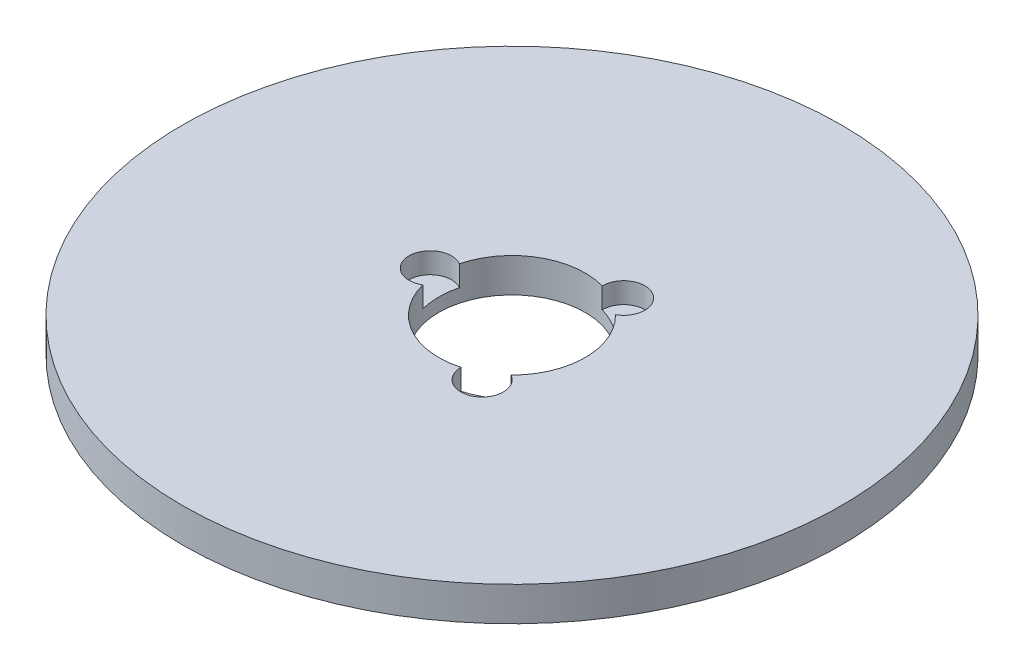
ISO-10303-21;
HEADER;
FILE_DESCRIPTION(('STEP AP214'),'2;1');
FILE_NAME('part.step','',(''),(''),'','','');
FILE_SCHEMA(('AUTOMOTIVE_DESIGN { 1 0 10303 214 1 1 1 1 }'));
ENDSEC;
DATA;
#1=APPLICATION_CONTEXT('core data for automotive mechanical design processes');
#2=APPLICATION_PROTOCOL_DEFINITION('international standard','automotive_design',2000,#1);
#3=PRODUCT_CONTEXT('',#1,'mechanical');
#4=PRODUCT('Part','Part','',(#3));
#5=PRODUCT_RELATED_PRODUCT_CATEGORY('part','',(#4));
#6=PRODUCT_DEFINITION_FORMATION('','',#4);
#7=PRODUCT_DEFINITION_CONTEXT('part definition',#1,'design');
#8=PRODUCT_DEFINITION('design','',#6,#7);
#9=PRODUCT_DEFINITION_SHAPE('','',#8);
#10=(LENGTH_UNIT() NAMED_UNIT(*) SI_UNIT(.MILLI.,.METRE.));
#11=(NAMED_UNIT(*) PLANE_ANGLE_UNIT() SI_UNIT($,.RADIAN.));
#12=(NAMED_UNIT(*) SI_UNIT($,.STERADIAN.) SOLID_ANGLE_UNIT());
#13=UNCERTAINTY_MEASURE_WITH_UNIT(LENGTH_MEASURE(1.E-05),#10,'distance_accuracy_value','');
#14=(GEOMETRIC_REPRESENTATION_CONTEXT(3) GLOBAL_UNCERTAINTY_ASSIGNED_CONTEXT((#13)) GLOBAL_UNIT_ASSIGNED_CONTEXT((#10,
#11,#12)) REPRESENTATION_CONTEXT('',''));
#15=CARTESIAN_POINT('',(0.,0.,0.));
#16=DIRECTION('',(0.,0.,1.));
#17=DIRECTION('',(1.,0.,0.));
#18=AXIS2_PLACEMENT_3D('',#15,#16,#17);
#19=CARTESIAN_POINT('',(0.,7.,0.));
#20=DIRECTION('',(0.,-1.,0.));
#21=DIRECTION('',(0.,0.,-1.));
#22=AXIS2_PLACEMENT_3D('',#19,#20,#21);
#23=CYLINDRICAL_SURFACE('',#22,67.5);
#24=CARTESIAN_POINT('',(0.,7.,0.));
#25=DIRECTION('',(0.,1.,0.));
#26=DIRECTION('',(0.,0.,1.));
#27=AXIS2_PLACEMENT_3D('',#24,#25,#26);
#28=CIRCLE('',#27,67.5);
#29=CARTESIAN_POINT('',(0.,7.,67.5));
#30=VERTEX_POINT('',#29);
#31=EDGE_CURVE('E126',#30,#30,#28,.T.);
#32=ORIENTED_EDGE('',*,*,#31,.F.);
#33=EDGE_LOOP('',(#32));
#34=FACE_BOUND('',#33,.T.);
#35=CARTESIAN_POINT('',(0.,0.,0.));
#36=DIRECTION('',(0.,1.,0.));
#37=DIRECTION('',(0.,0.,1.));
#38=AXIS2_PLACEMENT_3D('',#35,#36,#37);
#39=CIRCLE('',#38,67.5);
#40=CARTESIAN_POINT('',(0.,0.,67.5));
#41=VERTEX_POINT('',#40);
#42=EDGE_CURVE('E124',#41,#41,#39,.T.);
#43=ORIENTED_EDGE('',*,*,#42,.T.);
#44=EDGE_LOOP('',(#43));
#45=FACE_BOUND('',#44,.T.);
#46=ADVANCED_FACE('F39',(#34,#45),#23,.T.);
#47=CARTESIAN_POINT('',(0.,7.,0.));
#48=DIRECTION('',(0.,1.,0.));
#49=DIRECTION('',(0.,0.,1.));
#50=AXIS2_PLACEMENT_3D('',#47,#48,#49);
#51=PLANE('',#50);
#52=CARTESIAN_POINT('',(8.36943908511699,7.,14.4962937262753));
#53=DIRECTION('',(0.,1.,0.));
#54=DIRECTION('',(0.866025403784436,0.,-0.500000000000004));
#55=AXIS2_PLACEMENT_3D('',#52,#53,#54);
#56=CIRCLE('',#55,4.3513850673904);
#57=CARTESIAN_POINT('',(4.01828189581641,7.,14.451761505289));
#58=VERTEX_POINT('',#57);
#59=CARTESIAN_POINT('',(10.5064516451062,7.,10.7058149539885));
#60=VERTEX_POINT('',#59);
#61=EDGE_CURVE('E147',#58,#60,#56,.T.);
#62=ORIENTED_EDGE('',*,*,#61,.F.);
#63=CARTESIAN_POINT('',(0.,7.,0.));
#64=DIRECTION('',(0.,1.,0.));
#65=DIRECTION('',(0.,0.,1.));
#66=AXIS2_PLACEMENT_3D('',#63,#64,#65);
#67=CIRCLE('',#66,15.);
#68=CARTESIAN_POINT('',(-14.5247335409225,7.,3.74594655130048));
#69=VERTEX_POINT('',#68);
#70=EDGE_CURVE('E118',#69,#58,#67,.T.);
#71=ORIENTED_EDGE('',*,*,#70,.F.);
#72=CARTESIAN_POINT('',(-16.7388781702338,7.,0.));
#73=DIRECTION('',(0.,1.,0.));
#74=DIRECTION('',(0.,0.,1.));
#75=AXIS2_PLACEMENT_3D('',#72,#73,#74);
#76=CIRCLE('',#75,4.3513850673904);
#77=CARTESIAN_POINT('',(-14.5247335409225,7.,-3.74594655130048));
#78=VERTEX_POINT('',#77);
#79=EDGE_CURVE('E113',#78,#69,#76,.T.);
#80=ORIENTED_EDGE('',*,*,#79,.F.);
#81=CARTESIAN_POINT('',(4.0182818958162,7.,-14.4517615052891));
#82=VERTEX_POINT('',#81);
#83=EDGE_CURVE('E106',#82,#78,#67,.T.);
#84=ORIENTED_EDGE('',*,*,#83,.F.);
#85=CARTESIAN_POINT('',(8.36943908511679,7.,-14.4962937262754));
#86=DIRECTION('',(0.,1.,0.));
#87=DIRECTION('',(-0.866025403784443,0.,-0.499999999999992));
#88=AXIS2_PLACEMENT_3D('',#85,#86,#87);
#89=CIRCLE('',#88,4.3513850673904);
#90=CARTESIAN_POINT('',(10.5064516451061,7.,-10.7058149539887));
#91=VERTEX_POINT('',#90);
#92=EDGE_CURVE('E90',#91,#82,#89,.T.);
#93=ORIENTED_EDGE('',*,*,#92,.F.);
#94=EDGE_CURVE('E116',#60,#91,#67,.T.);
#95=ORIENTED_EDGE('',*,*,#94,.F.);
#96=EDGE_LOOP('',(#62,#71,#80,#84,#93,#95));
#97=FACE_BOUND('',#96,.T.);
#98=ORIENTED_EDGE('',*,*,#31,.T.);
#99=EDGE_LOOP('',(#98));
#100=FACE_BOUND('',#99,.T.);
#101=ADVANCED_FACE('F115',(#97,#100),#51,.T.);
#102=CARTESIAN_POINT('',(0.,0.,0.));
#103=DIRECTION('',(0.,1.,0.));
#104=DIRECTION('',(0.,0.,1.));
#105=AXIS2_PLACEMENT_3D('',#102,#103,#104);
#106=PLANE('',#105);
#107=CARTESIAN_POINT('',(0.,0.,0.));
#108=DIRECTION('',(0.,1.,0.));
#109=DIRECTION('',(0.,0.,1.));
#110=AXIS2_PLACEMENT_3D('',#107,#108,#109);
#111=CIRCLE('',#110,15.);
#112=CARTESIAN_POINT('',(0.,0.,15.));
#113=VERTEX_POINT('',#112);
#114=EDGE_CURVE('E120',#113,#113,#111,.T.);
#115=ORIENTED_EDGE('',*,*,#114,.T.);
#116=EDGE_LOOP('',(#115));
#117=FACE_BOUND('',#116,.T.);
#118=ORIENTED_EDGE('',*,*,#42,.F.);
#119=EDGE_LOOP('',(#118));
#120=FACE_BOUND('',#119,.T.);
#121=ADVANCED_FACE('F164',(#117,#120),#106,.F.);
#122=CARTESIAN_POINT('',(0.,7.,0.));
#123=DIRECTION('',(0.,-1.,0.));
#124=DIRECTION('',(0.,0.,-1.));
#125=AXIS2_PLACEMENT_3D('',#122,#123,#124);
#126=CYLINDRICAL_SURFACE('',#125,15.);
#127=DIRECTION('',(0.,1.,0.));
#128=VECTOR('',#127,1.);
#129=CARTESIAN_POINT('',(4.01828189581641,4.87457820388767,14.451761505289));
#130=LINE('',#129,#128);
#131=CARTESIAN_POINT('',(4.01828189581641,2.74915640777535,14.451761505289));
#132=VERTEX_POINT('',#131);
#133=EDGE_CURVE('E11',#132,#58,#130,.T.);
#134=ORIENTED_EDGE('',*,*,#133,.F.);
#135=CARTESIAN_POINT('',(0.,2.74915640777535,0.));
#136=DIRECTION('',(0.,1.,0.));
#137=DIRECTION('',(0.,0.,1.));
#138=AXIS2_PLACEMENT_3D('',#135,#136,#137);
#139=CIRCLE('',#138,15.);
#140=CARTESIAN_POINT('',(10.5064516451062,2.74915640777535,10.7058149539885));
#141=VERTEX_POINT('',#140);
#142=EDGE_CURVE('E144',#132,#141,#139,.T.);
#143=ORIENTED_EDGE('',*,*,#142,.T.);
#144=DIRECTION('',(0.,1.,0.));
#145=VECTOR('',#144,1.);
#146=CARTESIAN_POINT('',(10.5064516451062,4.87457820388767,10.7058149539885));
#147=LINE('',#146,#145);
#148=EDGE_CURVE('E46',#60,#141,#147,.F.);
#149=ORIENTED_EDGE('',*,*,#148,.F.);
#150=ORIENTED_EDGE('',*,*,#94,.T.);
#151=DIRECTION('',(0.,1.,0.));
#152=VECTOR('',#151,1.);
#153=CARTESIAN_POINT('',(10.5064516451061,4.87457820388767,-10.7058149539887));
#154=LINE('',#153,#152);
#155=CARTESIAN_POINT('',(10.5064516451061,2.74915640777535,-10.7058149539887));
#156=VERTEX_POINT('',#155);
#157=EDGE_CURVE('E92',#156,#91,#154,.T.);
#158=ORIENTED_EDGE('',*,*,#157,.F.);
#159=CARTESIAN_POINT('',(0.,2.74915640777535,0.));
#160=DIRECTION('',(0.,1.,0.));
#161=DIRECTION('',(0.,0.,1.));
#162=AXIS2_PLACEMENT_3D('',#159,#160,#161);
#163=CIRCLE('',#162,15.);
#164=CARTESIAN_POINT('',(4.0182818958162,2.74915640777535,-14.4517615052891));
#165=VERTEX_POINT('',#164);
#166=EDGE_CURVE('E107',#156,#165,#163,.T.);
#167=ORIENTED_EDGE('',*,*,#166,.T.);
#168=DIRECTION('',(0.,1.,0.));
#169=VECTOR('',#168,1.);
#170=CARTESIAN_POINT('',(4.0182818958162,4.87457820388767,-14.4517615052891));
#171=LINE('',#170,#169);
#172=EDGE_CURVE('E95',#82,#165,#171,.F.);
#173=ORIENTED_EDGE('',*,*,#172,.F.);
#174=ORIENTED_EDGE('',*,*,#83,.T.);
#175=DIRECTION('',(0.,1.,0.));
#176=VECTOR('',#175,1.);
#177=CARTESIAN_POINT('',(-14.5247335409225,4.87457820388767,-3.74594655130048));
#178=LINE('',#177,#176);
#179=CARTESIAN_POINT('',(-14.5247335409225,2.74915640777535,-3.74594655130048));
#180=VERTEX_POINT('',#179);
#181=EDGE_CURVE('E143',#180,#78,#178,.T.);
#182=ORIENTED_EDGE('',*,*,#181,.F.);
#183=CARTESIAN_POINT('',(0.,2.74915640777535,0.));
#184=DIRECTION('',(0.,1.,0.));
#185=DIRECTION('',(0.,0.,1.));
#186=AXIS2_PLACEMENT_3D('',#183,#184,#185);
#187=CIRCLE('',#186,15.);
#188=CARTESIAN_POINT('',(-14.5247335409225,2.74915640777535,3.74594655130048));
#189=VERTEX_POINT('',#188);
#190=EDGE_CURVE('E132',#180,#189,#187,.T.);
#191=ORIENTED_EDGE('',*,*,#190,.T.);
#192=DIRECTION('',(0.,1.,0.));
#193=VECTOR('',#192,1.);
#194=CARTESIAN_POINT('',(-14.5247335409225,4.87457820388767,3.74594655130048));
#195=LINE('',#194,#193);
#196=EDGE_CURVE('E137',#69,#189,#195,.F.);
#197=ORIENTED_EDGE('',*,*,#196,.F.);
#198=ORIENTED_EDGE('',*,*,#70,.T.);
#199=EDGE_LOOP('',(#134,#143,#149,#150,#158,#167,#173,#174,#182,#191,#197,#198));
#200=FACE_BOUND('',#199,.T.);
#201=ORIENTED_EDGE('',*,*,#114,.F.);
#202=EDGE_LOOP('',(#201));
#203=FACE_BOUND('',#202,.T.);
#204=ADVANCED_FACE('F103',(#200,#203),#126,.F.);
#205=CARTESIAN_POINT('',(-16.7388781702338,2.74915640777535,0.));
#206=DIRECTION('',(0.,1.,0.));
#207=DIRECTION('',(0.,0.,1.));
#208=AXIS2_PLACEMENT_3D('',#205,#206,#207);
#209=CYLINDRICAL_SURFACE('',#208,4.3513850673904);
#210=ORIENTED_EDGE('',*,*,#181,.T.);
#211=ORIENTED_EDGE('',*,*,#79,.T.);
#212=ORIENTED_EDGE('',*,*,#196,.T.);
#213=CARTESIAN_POINT('',(-16.7388781702338,2.74915640777535,0.));
#214=DIRECTION('',(0.,1.,0.));
#215=DIRECTION('',(0.,0.,1.));
#216=AXIS2_PLACEMENT_3D('',#213,#214,#215);
#217=CIRCLE('',#216,4.3513850673904);
#218=EDGE_CURVE('E121',#180,#189,#217,.T.);
#219=ORIENTED_EDGE('',*,*,#218,.F.);
#220=EDGE_LOOP('',(#210,#211,#212,#219));
#221=FACE_BOUND('',#220,.T.);
#222=ADVANCED_FACE('F174',(#221),#209,.F.);
#223=CARTESIAN_POINT('',(-16.7388781702338,2.74915640777535,0.));
#224=DIRECTION('',(0.,1.,0.));
#225=DIRECTION('',(0.,0.,1.));
#226=AXIS2_PLACEMENT_3D('',#223,#224,#225);
#227=PLANE('',#226);
#228=ORIENTED_EDGE('',*,*,#218,.T.);
#229=ORIENTED_EDGE('',*,*,#190,.F.);
#230=EDGE_LOOP('',(#228,#229));
#231=FACE_BOUND('',#230,.T.);
#232=ADVANCED_FACE('F177',(#231),#227,.T.);
#233=CARTESIAN_POINT('',(8.36943908511679,2.74915640777535,-14.4962937262754));
#234=DIRECTION('',(0.,1.,0.));
#235=DIRECTION('',(0.,0.,1.));
#236=AXIS2_PLACEMENT_3D('',#233,#234,#235);
#237=CYLINDRICAL_SURFACE('',#236,4.3513850673904);
#238=ORIENTED_EDGE('',*,*,#157,.T.);
#239=ORIENTED_EDGE('',*,*,#92,.T.);
#240=ORIENTED_EDGE('',*,*,#172,.T.);
#241=CARTESIAN_POINT('',(8.36943908511679,2.74915640777535,-14.4962937262754));
#242=DIRECTION('',(0.,1.,0.));
#243=DIRECTION('',(-0.866025403784443,0.,-0.499999999999992));
#244=AXIS2_PLACEMENT_3D('',#241,#242,#243);
#245=CIRCLE('',#244,4.3513850673904);
#246=EDGE_CURVE('E56',#156,#165,#245,.T.);
#247=ORIENTED_EDGE('',*,*,#246,.F.);
#248=EDGE_LOOP('',(#238,#239,#240,#247));
#249=FACE_BOUND('',#248,.T.);
#250=ADVANCED_FACE('F93',(#249),#237,.F.);
#251=CARTESIAN_POINT('',(8.36943908511679,2.74915640777535,-14.4962937262754));
#252=DIRECTION('',(0.,1.,0.));
#253=DIRECTION('',(-0.866025403784443,0.,-0.499999999999992));
#254=AXIS2_PLACEMENT_3D('',#251,#252,#253);
#255=PLANE('',#254);
#256=ORIENTED_EDGE('',*,*,#246,.T.);
#257=ORIENTED_EDGE('',*,*,#166,.F.);
#258=EDGE_LOOP('',(#256,#257));
#259=FACE_BOUND('',#258,.T.);
#260=ADVANCED_FACE('F160',(#259),#255,.T.);
#261=CARTESIAN_POINT('',(8.36943908511699,2.74915640777535,14.4962937262753));
#262=DIRECTION('',(0.,1.,0.));
#263=DIRECTION('',(0.,0.,1.));
#264=AXIS2_PLACEMENT_3D('',#261,#262,#263);
#265=CYLINDRICAL_SURFACE('',#264,4.3513850673904);
#266=ORIENTED_EDGE('',*,*,#133,.T.);
#267=ORIENTED_EDGE('',*,*,#61,.T.);
#268=ORIENTED_EDGE('',*,*,#148,.T.);
#269=CARTESIAN_POINT('',(8.36943908511699,2.74915640777535,14.4962937262753));
#270=DIRECTION('',(0.,1.,0.));
#271=DIRECTION('',(0.866025403784436,0.,-0.500000000000004));
#272=AXIS2_PLACEMENT_3D('',#269,#270,#271);
#273=CIRCLE('',#272,4.3513850673904);
#274=EDGE_CURVE('E55',#132,#141,#273,.T.);
#275=ORIENTED_EDGE('',*,*,#274,.F.);
#276=EDGE_LOOP('',(#266,#267,#268,#275));
#277=FACE_BOUND('',#276,.T.);
#278=ADVANCED_FACE('F149',(#277),#265,.F.);
#279=CARTESIAN_POINT('',(8.36943908511699,2.74915640777535,14.4962937262753));
#280=DIRECTION('',(0.,1.,0.));
#281=DIRECTION('',(0.866025403784436,0.,-0.500000000000004));
#282=AXIS2_PLACEMENT_3D('',#279,#280,#281);
#283=PLANE('',#282);
#284=ORIENTED_EDGE('',*,*,#274,.T.);
#285=ORIENTED_EDGE('',*,*,#142,.F.);
#286=EDGE_LOOP('',(#284,#285));
#287=FACE_BOUND('',#286,.T.);
#288=ADVANCED_FACE('F151',(#287),#283,.T.);
#289=CLOSED_SHELL('',(#46,#101,#121,#204,#222,#232,#250,#260,#278,#288));
#290=MANIFOLD_SOLID_BREP('B2',#289);
#291=ADVANCED_BREP_SHAPE_REPRESENTATION('',(#18,#290),#14);
#292=SHAPE_DEFINITION_REPRESENTATION(#9,#291);
ENDSEC;
END-ISO-10303-21;
